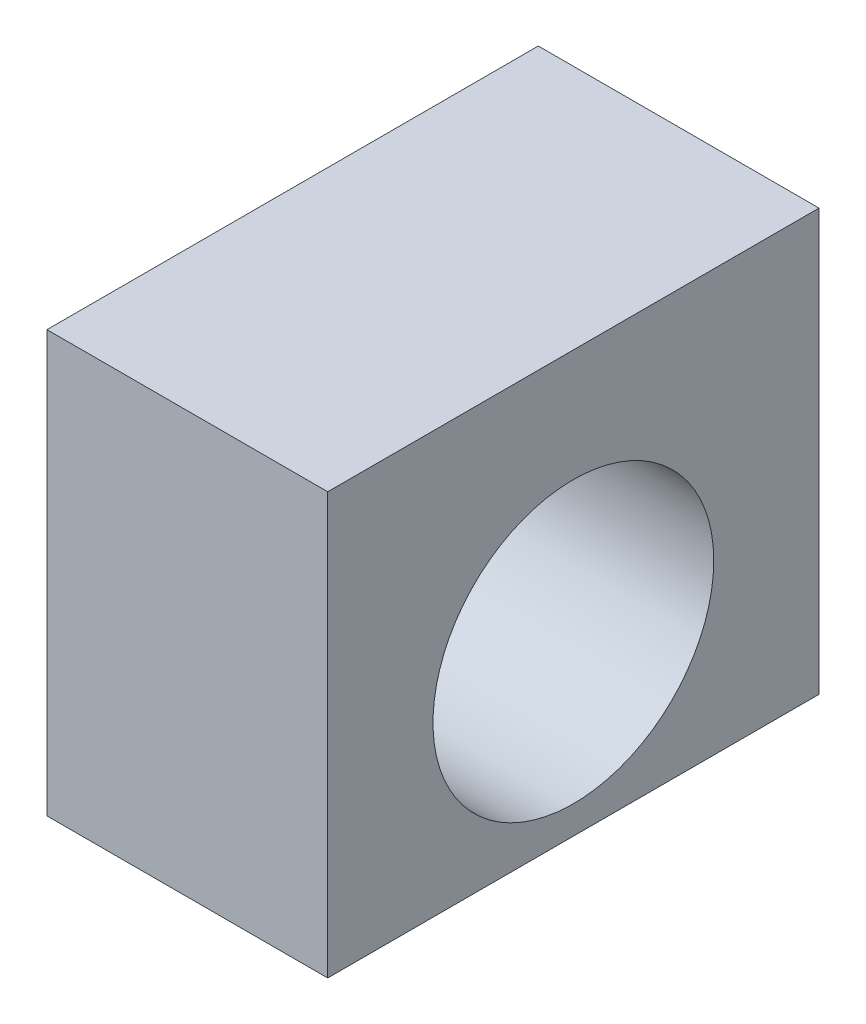
ISO-10303-21;
HEADER;
FILE_DESCRIPTION(('STEP AP214'),'2;1');
FILE_NAME('part.step','',(''),(''),'','','');
FILE_SCHEMA(('AUTOMOTIVE_DESIGN { 1 0 10303 214 1 1 1 1 }'));
ENDSEC;
DATA;
#1=APPLICATION_CONTEXT('core data for automotive mechanical design processes');
#2=APPLICATION_PROTOCOL_DEFINITION('international standard','automotive_design',2000,#1);
#3=PRODUCT_CONTEXT('',#1,'mechanical');
#4=PRODUCT('Part','Part','',(#3));
#5=PRODUCT_RELATED_PRODUCT_CATEGORY('part','',(#4));
#6=PRODUCT_DEFINITION_FORMATION('','',#4);
#7=PRODUCT_DEFINITION_CONTEXT('part definition',#1,'design');
#8=PRODUCT_DEFINITION('design','',#6,#7);
#9=PRODUCT_DEFINITION_SHAPE('','',#8);
#10=(LENGTH_UNIT() NAMED_UNIT(*) SI_UNIT(.MILLI.,.METRE.));
#11=(NAMED_UNIT(*) PLANE_ANGLE_UNIT() SI_UNIT($,.RADIAN.));
#12=(NAMED_UNIT(*) SI_UNIT($,.STERADIAN.) SOLID_ANGLE_UNIT());
#13=UNCERTAINTY_MEASURE_WITH_UNIT(LENGTH_MEASURE(1.E-05),#10,'distance_accuracy_value','');
#14=(GEOMETRIC_REPRESENTATION_CONTEXT(3) GLOBAL_UNCERTAINTY_ASSIGNED_CONTEXT((#13)) GLOBAL_UNIT_ASSIGNED_CONTEXT((#10,
#11,#12)) REPRESENTATION_CONTEXT('',''));
#15=CARTESIAN_POINT('',(0.,0.,0.));
#16=DIRECTION('',(0.,0.,1.));
#17=DIRECTION('',(1.,0.,0.));
#18=AXIS2_PLACEMENT_3D('',#15,#16,#17);
#19=CARTESIAN_POINT('',(12.7,0.,0.));
#20=DIRECTION('',(1.,0.,0.));
#21=DIRECTION('',(0.,0.,-1.));
#22=AXIS2_PLACEMENT_3D('',#19,#20,#21);
#23=PLANE('',#22);
#24=DIRECTION('',(0.,-1.,0.));
#25=VECTOR('',#24,1.);
#26=CARTESIAN_POINT('',(12.7,0.,0.));
#27=LINE('',#26,#25);
#28=CARTESIAN_POINT('',(12.7,0.,0.));
#29=VERTEX_POINT('',#28);
#30=CARTESIAN_POINT('',(12.7,-19.05,0.));
#31=VERTEX_POINT('',#30);
#32=EDGE_CURVE('E84',#29,#31,#27,.T.);
#33=ORIENTED_EDGE('',*,*,#32,.T.);
#34=DIRECTION('',(0.,0.,-1.));
#35=VECTOR('',#34,1.);
#36=CARTESIAN_POINT('',(12.7,-19.05,0.));
#37=LINE('',#36,#35);
#38=CARTESIAN_POINT('',(12.7,-19.05,-22.225));
#39=VERTEX_POINT('',#38);
#40=EDGE_CURVE('E79',#31,#39,#37,.T.);
#41=ORIENTED_EDGE('',*,*,#40,.T.);
#42=DIRECTION('',(0.,1.,0.));
#43=VECTOR('',#42,1.);
#44=CARTESIAN_POINT('',(12.7,0.,-22.225));
#45=LINE('',#44,#43);
#46=CARTESIAN_POINT('',(12.7,0.,-22.225));
#47=VERTEX_POINT('',#46);
#48=EDGE_CURVE('E82',#39,#47,#45,.T.);
#49=ORIENTED_EDGE('',*,*,#48,.T.);
#50=DIRECTION('',(0.,0.,1.));
#51=VECTOR('',#50,1.);
#52=CARTESIAN_POINT('',(12.7,0.,0.));
#53=LINE('',#52,#51);
#54=EDGE_CURVE('E49',#47,#29,#53,.T.);
#55=ORIENTED_EDGE('',*,*,#54,.T.);
#56=EDGE_LOOP('',(#33,#41,#49,#55));
#57=FACE_BOUND('',#56,.T.);
#58=CARTESIAN_POINT('',(12.7,-11.43,-11.1125));
#59=DIRECTION('',(1.,0.,0.));
#60=DIRECTION('',(0.,0.,-1.));
#61=AXIS2_PLACEMENT_3D('',#58,#59,#60);
#62=CIRCLE('',#61,6.35000000000001);
#63=CARTESIAN_POINT('',(12.7,-11.43,-17.4625));
#64=VERTEX_POINT('',#63);
#65=EDGE_CURVE('E99',#64,#64,#62,.T.);
#66=ORIENTED_EDGE('',*,*,#65,.F.);
#67=EDGE_LOOP('',(#66));
#68=FACE_BOUND('',#67,.T.);
#69=ADVANCED_FACE('F32',(#57,#68),#23,.T.);
#70=CARTESIAN_POINT('',(0.,0.,0.));
#71=DIRECTION('',(1.,0.,0.));
#72=DIRECTION('',(0.,0.,-1.));
#73=AXIS2_PLACEMENT_3D('',#70,#71,#72);
#74=PLANE('',#73);
#75=DIRECTION('',(0.,-1.,0.));
#76=VECTOR('',#75,1.);
#77=CARTESIAN_POINT('',(0.,0.,0.));
#78=LINE('',#77,#76);
#79=CARTESIAN_POINT('',(0.,0.,0.));
#80=VERTEX_POINT('',#79);
#81=CARTESIAN_POINT('',(0.,-19.05,0.));
#82=VERTEX_POINT('',#81);
#83=EDGE_CURVE('E96',#80,#82,#78,.T.);
#84=ORIENTED_EDGE('',*,*,#83,.F.);
#85=DIRECTION('',(0.,0.,1.));
#86=VECTOR('',#85,1.);
#87=CARTESIAN_POINT('',(0.,0.,0.));
#88=LINE('',#87,#86);
#89=CARTESIAN_POINT('',(0.,0.,-22.225));
#90=VERTEX_POINT('',#89);
#91=EDGE_CURVE('E72',#90,#80,#88,.T.);
#92=ORIENTED_EDGE('',*,*,#91,.F.);
#93=DIRECTION('',(0.,1.,0.));
#94=VECTOR('',#93,1.);
#95=CARTESIAN_POINT('',(0.,0.,-22.225));
#96=LINE('',#95,#94);
#97=CARTESIAN_POINT('',(0.,-19.05,-22.225));
#98=VERTEX_POINT('',#97);
#99=EDGE_CURVE('E66',#98,#90,#96,.T.);
#100=ORIENTED_EDGE('',*,*,#99,.F.);
#101=DIRECTION('',(0.,0.,-1.));
#102=VECTOR('',#101,1.);
#103=CARTESIAN_POINT('',(0.,-19.05,0.));
#104=LINE('',#103,#102);
#105=EDGE_CURVE('E88',#82,#98,#104,.T.);
#106=ORIENTED_EDGE('',*,*,#105,.F.);
#107=EDGE_LOOP('',(#84,#92,#100,#106));
#108=FACE_BOUND('',#107,.T.);
#109=CARTESIAN_POINT('',(0.,-11.43,-11.1125));
#110=DIRECTION('',(1.,0.,0.));
#111=DIRECTION('',(0.,0.,-1.));
#112=AXIS2_PLACEMENT_3D('',#109,#110,#111);
#113=CIRCLE('',#112,6.35000000000001);
#114=CARTESIAN_POINT('',(0.,-11.43,-17.4625));
#115=VERTEX_POINT('',#114);
#116=EDGE_CURVE('E111',#115,#115,#113,.T.);
#117=ORIENTED_EDGE('',*,*,#116,.T.);
#118=EDGE_LOOP('',(#117));
#119=FACE_BOUND('',#118,.T.);
#120=ADVANCED_FACE('F107',(#108,#119),#74,.F.);
#121=CARTESIAN_POINT('',(12.7,0.,0.));
#122=DIRECTION('',(0.,0.,-1.));
#123=DIRECTION('',(0.,1.,0.));
#124=AXIS2_PLACEMENT_3D('',#121,#122,#123);
#125=PLANE('',#124);
#126=ORIENTED_EDGE('',*,*,#83,.T.);
#127=DIRECTION('',(-1.,0.,0.));
#128=VECTOR('',#127,1.);
#129=CARTESIAN_POINT('',(12.7,-19.05,0.));
#130=LINE('',#129,#128);
#131=EDGE_CURVE('E11',#31,#82,#130,.T.);
#132=ORIENTED_EDGE('',*,*,#131,.F.);
#133=ORIENTED_EDGE('',*,*,#32,.F.);
#134=DIRECTION('',(-1.,0.,0.));
#135=VECTOR('',#134,1.);
#136=CARTESIAN_POINT('',(12.7,0.,0.));
#137=LINE('',#136,#135);
#138=EDGE_CURVE('E92',#29,#80,#137,.T.);
#139=ORIENTED_EDGE('',*,*,#138,.T.);
#140=EDGE_LOOP('',(#126,#132,#133,#139));
#141=FACE_BOUND('',#140,.T.);
#142=ADVANCED_FACE('F34',(#141),#125,.F.);
#143=CARTESIAN_POINT('',(12.7,-19.05,0.));
#144=DIRECTION('',(0.,1.,0.));
#145=DIRECTION('',(0.,0.,1.));
#146=AXIS2_PLACEMENT_3D('',#143,#144,#145);
#147=PLANE('',#146);
#148=ORIENTED_EDGE('',*,*,#105,.T.);
#149=DIRECTION('',(-1.,0.,0.));
#150=VECTOR('',#149,1.);
#151=CARTESIAN_POINT('',(12.7,-19.05,-22.225));
#152=LINE('',#151,#150);
#153=EDGE_CURVE('E41',#39,#98,#152,.T.);
#154=ORIENTED_EDGE('',*,*,#153,.F.);
#155=ORIENTED_EDGE('',*,*,#40,.F.);
#156=ORIENTED_EDGE('',*,*,#131,.T.);
#157=EDGE_LOOP('',(#148,#154,#155,#156));
#158=FACE_BOUND('',#157,.T.);
#159=ADVANCED_FACE('F87',(#158),#147,.F.);
#160=CARTESIAN_POINT('',(12.7,0.,-22.225));
#161=DIRECTION('',(0.,0.,1.));
#162=DIRECTION('',(1.,0.,0.));
#163=AXIS2_PLACEMENT_3D('',#160,#161,#162);
#164=PLANE('',#163);
#165=ORIENTED_EDGE('',*,*,#99,.T.);
#166=DIRECTION('',(-1.,0.,0.));
#167=VECTOR('',#166,1.);
#168=CARTESIAN_POINT('',(12.7,0.,-22.225));
#169=LINE('',#168,#167);
#170=EDGE_CURVE('E89',#47,#90,#169,.T.);
#171=ORIENTED_EDGE('',*,*,#170,.F.);
#172=ORIENTED_EDGE('',*,*,#48,.F.);
#173=ORIENTED_EDGE('',*,*,#153,.T.);
#174=EDGE_LOOP('',(#165,#171,#172,#173));
#175=FACE_BOUND('',#174,.T.);
#176=ADVANCED_FACE('F90',(#175),#164,.F.);
#177=CARTESIAN_POINT('',(12.7,0.,0.));
#178=DIRECTION('',(0.,-1.,0.));
#179=DIRECTION('',(0.,0.,-1.));
#180=AXIS2_PLACEMENT_3D('',#177,#178,#179);
#181=PLANE('',#180);
#182=ORIENTED_EDGE('',*,*,#91,.T.);
#183=ORIENTED_EDGE('',*,*,#138,.F.);
#184=ORIENTED_EDGE('',*,*,#54,.F.);
#185=ORIENTED_EDGE('',*,*,#170,.T.);
#186=EDGE_LOOP('',(#182,#183,#184,#185));
#187=FACE_BOUND('',#186,.T.);
#188=ADVANCED_FACE('F104',(#187),#181,.F.);
#189=CARTESIAN_POINT('',(12.7,-11.43,-11.1125));
#190=DIRECTION('',(-1.,0.,0.));
#191=DIRECTION('',(0.,0.,1.));
#192=AXIS2_PLACEMENT_3D('',#189,#190,#191);
#193=CYLINDRICAL_SURFACE('',#192,6.35000000000001);
#194=ORIENTED_EDGE('',*,*,#65,.T.);
#195=EDGE_LOOP('',(#194));
#196=FACE_BOUND('',#195,.T.);
#197=ORIENTED_EDGE('',*,*,#116,.F.);
#198=EDGE_LOOP('',(#197));
#199=FACE_BOUND('',#198,.T.);
#200=ADVANCED_FACE('F117',(#196,#199),#193,.F.);
#201=CLOSED_SHELL('',(#69,#120,#142,#159,#176,#188,#200));
#202=MANIFOLD_SOLID_BREP('B2',#201);
#203=ADVANCED_BREP_SHAPE_REPRESENTATION('',(#18,#202),#14);
#204=SHAPE_DEFINITION_REPRESENTATION(#9,#203);
ENDSEC;
END-ISO-10303-21;
